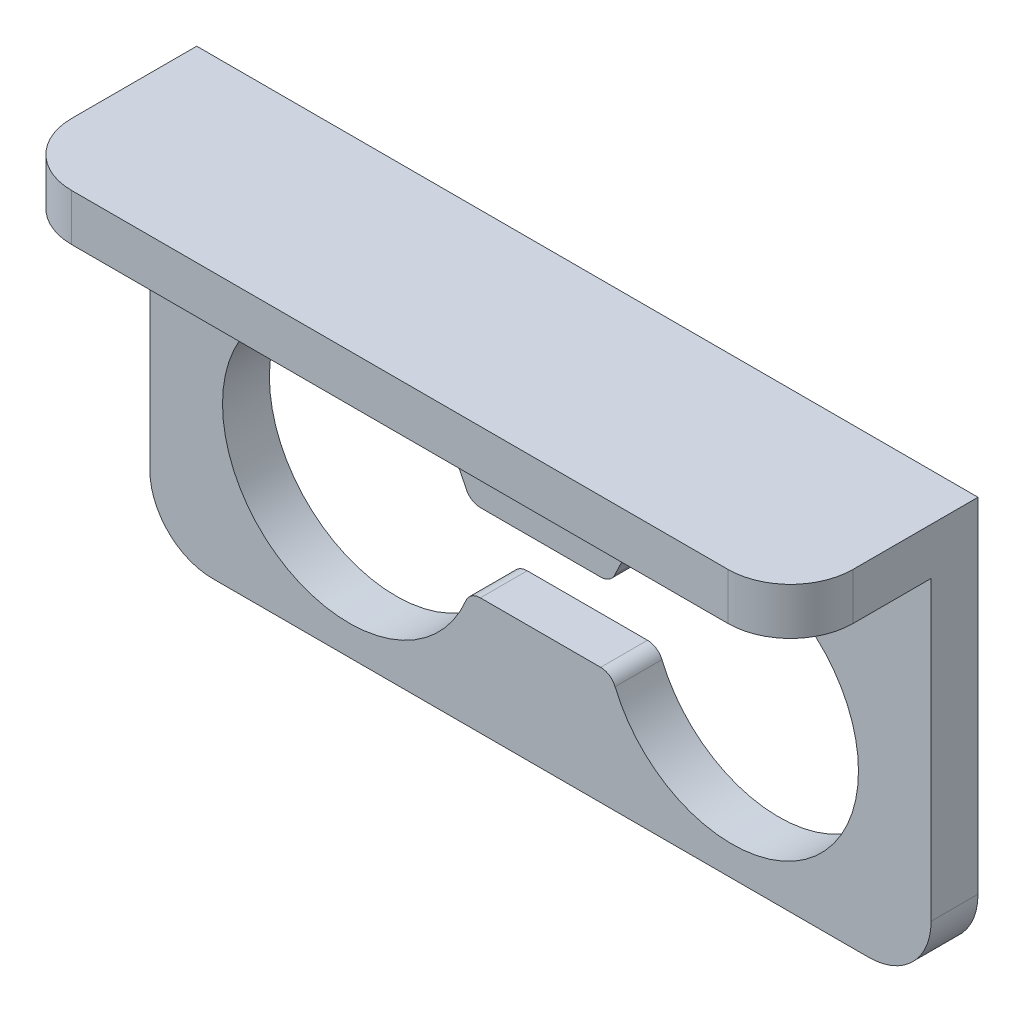
ISO-10303-21;
HEADER;
FILE_DESCRIPTION(('STEP AP214'),'2;1');
FILE_NAME('part.step','',(''),(''),'','','');
FILE_SCHEMA(('AUTOMOTIVE_DESIGN { 1 0 10303 214 1 1 1 1 }'));
ENDSEC;
DATA;
#1=APPLICATION_CONTEXT('core data for automotive mechanical design processes');
#2=APPLICATION_PROTOCOL_DEFINITION('international standard','automotive_design',2000,#1);
#3=PRODUCT_CONTEXT('',#1,'mechanical');
#4=PRODUCT('Part','Part','',(#3));
#5=PRODUCT_RELATED_PRODUCT_CATEGORY('part','',(#4));
#6=PRODUCT_DEFINITION_FORMATION('','',#4);
#7=PRODUCT_DEFINITION_CONTEXT('part definition',#1,'design');
#8=PRODUCT_DEFINITION('design','',#6,#7);
#9=PRODUCT_DEFINITION_SHAPE('','',#8);
#10=(LENGTH_UNIT() NAMED_UNIT(*) SI_UNIT(.MILLI.,.METRE.));
#11=(NAMED_UNIT(*) PLANE_ANGLE_UNIT() SI_UNIT($,.RADIAN.));
#12=(NAMED_UNIT(*) SI_UNIT($,.STERADIAN.) SOLID_ANGLE_UNIT());
#13=UNCERTAINTY_MEASURE_WITH_UNIT(LENGTH_MEASURE(1.E-05),#10,'distance_accuracy_value','');
#14=(GEOMETRIC_REPRESENTATION_CONTEXT(3) GLOBAL_UNCERTAINTY_ASSIGNED_CONTEXT((#13)) GLOBAL_UNIT_ASSIGNED_CONTEXT((#10,
#11,#12)) REPRESENTATION_CONTEXT('',''));
#15=CARTESIAN_POINT('',(0.,0.,0.));
#16=DIRECTION('',(0.,0.,1.));
#17=DIRECTION('',(1.,0.,0.));
#18=AXIS2_PLACEMENT_3D('',#15,#16,#17);
#19=CARTESIAN_POINT('',(-25.,16.,12.));
#20=DIRECTION('',(0.,0.,-1.));
#21=DIRECTION('',(-1.,0.,0.));
#22=AXIS2_PLACEMENT_3D('',#19,#20,#21);
#23=PLANE('',#22);
#24=DIRECTION('',(1.,0.,0.));
#25=VECTOR('',#24,1.);
#26=CARTESIAN_POINT('',(-25.,16.,12.));
#27=LINE('',#26,#25);
#28=CARTESIAN_POINT('',(-21.,16.,12.));
#29=VERTEX_POINT('',#28);
#30=CARTESIAN_POINT('',(21.,16.,12.));
#31=VERTEX_POINT('',#30);
#32=EDGE_CURVE('E221',#29,#31,#27,.T.);
#33=ORIENTED_EDGE('',*,*,#32,.F.);
#34=DIRECTION('',(0.,-1.,0.));
#35=VECTOR('',#34,1.);
#36=CARTESIAN_POINT('',(-21.,16.,12.));
#37=LINE('',#36,#35);
#38=CARTESIAN_POINT('',(-21.,13.,12.));
#39=VERTEX_POINT('',#38);
#40=EDGE_CURVE('E377',#29,#39,#37,.T.);
#41=ORIENTED_EDGE('',*,*,#40,.T.);
#42=DIRECTION('',(-1.,0.,0.));
#43=VECTOR('',#42,1.);
#44=CARTESIAN_POINT('',(25.,13.,12.));
#45=LINE('',#44,#43);
#46=CARTESIAN_POINT('',(21.,13.,12.));
#47=VERTEX_POINT('',#46);
#48=EDGE_CURVE('E201',#47,#39,#45,.T.);
#49=ORIENTED_EDGE('',*,*,#48,.F.);
#50=DIRECTION('',(0.,-1.,0.));
#51=VECTOR('',#50,1.);
#52=CARTESIAN_POINT('',(21.,16.,12.));
#53=LINE('',#52,#51);
#54=EDGE_CURVE('E367',#47,#31,#53,.F.);
#55=ORIENTED_EDGE('',*,*,#54,.T.);
#56=EDGE_LOOP('',(#33,#41,#49,#55));
#57=FACE_BOUND('',#56,.T.);
#58=ADVANCED_FACE('F39',(#57),#23,.F.);
#59=CARTESIAN_POINT('',(0.,0.,3.));
#60=DIRECTION('',(0.,0.,1.));
#61=DIRECTION('',(1.,0.,0.));
#62=AXIS2_PLACEMENT_3D('',#59,#60,#61);
#63=PLANE('',#62);
#64=DIRECTION('',(1.,0.,0.));
#65=VECTOR('',#64,1.);
#66=CARTESIAN_POINT('',(25.,-10.,3.));
#67=LINE('',#66,#65);
#68=CARTESIAN_POINT('',(-21.,-10.,3.));
#69=VERTEX_POINT('',#68);
#70=CARTESIAN_POINT('',(21.,-10.,3.));
#71=VERTEX_POINT('',#70);
#72=EDGE_CURVE('E209',#69,#71,#67,.T.);
#73=ORIENTED_EDGE('',*,*,#72,.T.);
#74=CARTESIAN_POINT('',(21.,-6.,3.));
#75=DIRECTION('',(0.,0.,1.));
#76=DIRECTION('',(1.,0.,0.));
#77=AXIS2_PLACEMENT_3D('',#74,#75,#76);
#78=CIRCLE('',#77,4.);
#79=CARTESIAN_POINT('',(25.,-6.,3.));
#80=VERTEX_POINT('',#79);
#81=EDGE_CURVE('E11',#71,#80,#78,.T.);
#82=ORIENTED_EDGE('',*,*,#81,.T.);
#83=DIRECTION('',(0.,1.,0.));
#84=VECTOR('',#83,1.);
#85=CARTESIAN_POINT('',(25.,-10.,3.));
#86=LINE('',#85,#84);
#87=CARTESIAN_POINT('',(25.,13.,3.));
#88=VERTEX_POINT('',#87);
#89=EDGE_CURVE('E215',#80,#88,#86,.T.);
#90=ORIENTED_EDGE('',*,*,#89,.T.);
#91=DIRECTION('',(1.,0.,0.));
#92=VECTOR('',#91,1.);
#93=CARTESIAN_POINT('',(25.,13.,3.));
#94=LINE('',#93,#92);
#95=CARTESIAN_POINT('',(-25.,13.,3.));
#96=VERTEX_POINT('',#95);
#97=EDGE_CURVE('E195',#96,#88,#94,.T.);
#98=ORIENTED_EDGE('',*,*,#97,.F.);
#99=DIRECTION('',(0.,-1.,0.));
#100=VECTOR('',#99,1.);
#101=CARTESIAN_POINT('',(-25.,-10.,3.));
#102=LINE('',#101,#100);
#103=CARTESIAN_POINT('',(-25.,-6.,3.));
#104=VERTEX_POINT('',#103);
#105=EDGE_CURVE('E203',#96,#104,#102,.T.);
#106=ORIENTED_EDGE('',*,*,#105,.T.);
#107=CARTESIAN_POINT('',(-21.,-6.,3.));
#108=DIRECTION('',(0.,0.,1.));
#109=DIRECTION('',(1.,0.,0.));
#110=AXIS2_PLACEMENT_3D('',#107,#108,#109);
#111=CIRCLE('',#110,4.);
#112=EDGE_CURVE('E48',#104,#69,#111,.T.);
#113=ORIENTED_EDGE('',*,*,#112,.T.);
#114=EDGE_LOOP('',(#73,#82,#90,#98,#106,#113));
#115=FACE_BOUND('',#114,.T.);
#116=CARTESIAN_POINT('',(12.25,0.,3.));
#117=DIRECTION('',(0.,0.,1.));
#118=DIRECTION('',(1.,0.,0.));
#119=AXIS2_PLACEMENT_3D('',#116,#117,#118);
#120=CIRCLE('',#119,8.1);
#121=CARTESIAN_POINT('',(4.77307692307692,-3.11538461538461,3.));
#122=VERTEX_POINT('',#121);
#123=CARTESIAN_POINT('',(4.77307692307692,3.11538461538462,3.));
#124=VERTEX_POINT('',#123);
#125=EDGE_CURVE('E283',#122,#124,#120,.T.);
#126=ORIENTED_EDGE('',*,*,#125,.F.);
#127=CARTESIAN_POINT('',(3.85,-3.5,3.));
#128=DIRECTION('',(0.,0.,-1.));
#129=DIRECTION('',(-1.,0.,0.));
#130=AXIS2_PLACEMENT_3D('',#127,#128,#129);
#131=CIRCLE('',#130,1.);
#132=CARTESIAN_POINT('',(3.85,-2.5,3.));
#133=VERTEX_POINT('',#132);
#134=EDGE_CURVE('E280',#133,#122,#131,.T.);
#135=ORIENTED_EDGE('',*,*,#134,.F.);
#136=DIRECTION('',(1.,0.,0.));
#137=VECTOR('',#136,1.);
#138=CARTESIAN_POINT('',(3.85,-2.5,3.));
#139=LINE('',#138,#137);
#140=CARTESIAN_POINT('',(-3.85,-2.5,3.));
#141=VERTEX_POINT('',#140);
#142=EDGE_CURVE('E303',#141,#133,#139,.T.);
#143=ORIENTED_EDGE('',*,*,#142,.F.);
#144=CARTESIAN_POINT('',(-3.85,-3.5,3.));
#145=DIRECTION('',(0.,0.,-1.));
#146=DIRECTION('',(1.,0.,0.));
#147=AXIS2_PLACEMENT_3D('',#144,#145,#146);
#148=CIRCLE('',#147,1.);
#149=CARTESIAN_POINT('',(-4.77307692307692,-3.11538461538462,3.));
#150=VERTEX_POINT('',#149);
#151=EDGE_CURVE('E299',#150,#141,#148,.T.);
#152=ORIENTED_EDGE('',*,*,#151,.F.);
#153=CARTESIAN_POINT('',(-12.25,0.,3.));
#154=DIRECTION('',(0.,0.,1.));
#155=DIRECTION('',(1.,0.,0.));
#156=AXIS2_PLACEMENT_3D('',#153,#154,#155);
#157=CIRCLE('',#156,8.1);
#158=CARTESIAN_POINT('',(-4.77307692307692,3.11538461538461,3.));
#159=VERTEX_POINT('',#158);
#160=EDGE_CURVE('E296',#159,#150,#157,.T.);
#161=ORIENTED_EDGE('',*,*,#160,.F.);
#162=CARTESIAN_POINT('',(-3.85,3.5,3.));
#163=DIRECTION('',(0.,0.,-1.));
#164=DIRECTION('',(-1.,0.,0.));
#165=AXIS2_PLACEMENT_3D('',#162,#163,#164);
#166=CIRCLE('',#165,1.);
#167=CARTESIAN_POINT('',(-3.85,2.5,3.));
#168=VERTEX_POINT('',#167);
#169=EDGE_CURVE('E293',#168,#159,#166,.T.);
#170=ORIENTED_EDGE('',*,*,#169,.F.);
#171=DIRECTION('',(-1.,0.,0.));
#172=VECTOR('',#171,1.);
#173=CARTESIAN_POINT('',(-3.85,2.5,3.));
#174=LINE('',#173,#172);
#175=CARTESIAN_POINT('',(3.85,2.5,3.));
#176=VERTEX_POINT('',#175);
#177=EDGE_CURVE('E290',#176,#168,#174,.T.);
#178=ORIENTED_EDGE('',*,*,#177,.F.);
#179=CARTESIAN_POINT('',(3.85,3.5,3.));
#180=DIRECTION('',(0.,0.,-1.));
#181=DIRECTION('',(1.,0.,0.));
#182=AXIS2_PLACEMENT_3D('',#179,#180,#181);
#183=CIRCLE('',#182,1.);
#184=EDGE_CURVE('E287',#124,#176,#183,.T.);
#185=ORIENTED_EDGE('',*,*,#184,.F.);
#186=EDGE_LOOP('',(#126,#135,#143,#152,#161,#170,#178,#185));
#187=FACE_BOUND('',#186,.T.);
#188=DIRECTION('',(-1.,0.,0.));
#189=VECTOR('',#188,1.);
#190=CARTESIAN_POINT('',(3.25,9.,3.));
#191=LINE('',#190,#189);
#192=CARTESIAN_POINT('',(3.25,9.,3.));
#193=VERTEX_POINT('',#192);
#194=CARTESIAN_POINT('',(-3.25,9.,3.));
#195=VERTEX_POINT('',#194);
#196=EDGE_CURVE('E240',#193,#195,#191,.T.);
#197=ORIENTED_EDGE('',*,*,#196,.F.);
#198=CARTESIAN_POINT('',(3.25,7.25,3.));
#199=DIRECTION('',(0.,0.,1.));
#200=DIRECTION('',(1.,0.,0.));
#201=AXIS2_PLACEMENT_3D('',#198,#199,#200);
#202=CIRCLE('',#201,1.75);
#203=CARTESIAN_POINT('',(3.25,5.5,3.));
#204=VERTEX_POINT('',#203);
#205=EDGE_CURVE('E237',#204,#193,#202,.T.);
#206=ORIENTED_EDGE('',*,*,#205,.F.);
#207=DIRECTION('',(1.,0.,0.));
#208=VECTOR('',#207,1.);
#209=CARTESIAN_POINT('',(3.25,5.5,3.));
#210=LINE('',#209,#208);
#211=CARTESIAN_POINT('',(-3.25,5.5,3.));
#212=VERTEX_POINT('',#211);
#213=EDGE_CURVE('E248',#212,#204,#210,.T.);
#214=ORIENTED_EDGE('',*,*,#213,.F.);
#215=CARTESIAN_POINT('',(-3.25,7.25,3.));
#216=DIRECTION('',(0.,0.,1.));
#217=DIRECTION('',(1.,0.,0.));
#218=AXIS2_PLACEMENT_3D('',#215,#216,#217);
#219=CIRCLE('',#218,1.75);
#220=EDGE_CURVE('E244',#195,#212,#219,.T.);
#221=ORIENTED_EDGE('',*,*,#220,.F.);
#222=EDGE_LOOP('',(#197,#206,#214,#221));
#223=FACE_BOUND('',#222,.T.);
#224=ADVANCED_FACE('F212',(#115,#187,#223),#63,.T.);
#225=CARTESIAN_POINT('',(0.,0.,0.));
#226=DIRECTION('',(0.,0.,1.));
#227=DIRECTION('',(1.,0.,0.));
#228=AXIS2_PLACEMENT_3D('',#225,#226,#227);
#229=PLANE('',#228);
#230=CARTESIAN_POINT('',(3.85,-3.5,0.));
#231=DIRECTION('',(0.,0.,-1.));
#232=DIRECTION('',(-1.,0.,0.));
#233=AXIS2_PLACEMENT_3D('',#230,#231,#232);
#234=CIRCLE('',#233,1.);
#235=CARTESIAN_POINT('',(3.85,-2.5,0.));
#236=VERTEX_POINT('',#235);
#237=CARTESIAN_POINT('',(4.77307692307692,-3.11538461538461,0.));
#238=VERTEX_POINT('',#237);
#239=EDGE_CURVE('E279',#236,#238,#234,.T.);
#240=ORIENTED_EDGE('',*,*,#239,.T.);
#241=CARTESIAN_POINT('',(12.25,0.,0.));
#242=DIRECTION('',(0.,0.,1.));
#243=DIRECTION('',(1.,0.,0.));
#244=AXIS2_PLACEMENT_3D('',#241,#242,#243);
#245=CIRCLE('',#244,8.1);
#246=CARTESIAN_POINT('',(4.77307692307692,3.11538461538462,0.));
#247=VERTEX_POINT('',#246);
#248=EDGE_CURVE('E310',#238,#247,#245,.T.);
#249=ORIENTED_EDGE('',*,*,#248,.T.);
#250=CARTESIAN_POINT('',(3.85,3.5,0.));
#251=DIRECTION('',(0.,0.,-1.));
#252=DIRECTION('',(1.,0.,0.));
#253=AXIS2_PLACEMENT_3D('',#250,#251,#252);
#254=CIRCLE('',#253,1.);
#255=CARTESIAN_POINT('',(3.85,2.5,0.));
#256=VERTEX_POINT('',#255);
#257=EDGE_CURVE('E314',#247,#256,#254,.T.);
#258=ORIENTED_EDGE('',*,*,#257,.T.);
#259=DIRECTION('',(-1.,0.,0.));
#260=VECTOR('',#259,1.);
#261=CARTESIAN_POINT('',(-3.85,2.5,0.));
#262=LINE('',#261,#260);
#263=CARTESIAN_POINT('',(-3.85,2.5,0.));
#264=VERTEX_POINT('',#263);
#265=EDGE_CURVE('E318',#256,#264,#262,.T.);
#266=ORIENTED_EDGE('',*,*,#265,.T.);
#267=CARTESIAN_POINT('',(-3.85,3.5,0.));
#268=DIRECTION('',(0.,0.,-1.));
#269=DIRECTION('',(-1.,0.,0.));
#270=AXIS2_PLACEMENT_3D('',#267,#268,#269);
#271=CIRCLE('',#270,1.);
#272=CARTESIAN_POINT('',(-4.77307692307692,3.11538461538461,0.));
#273=VERTEX_POINT('',#272);
#274=EDGE_CURVE('E322',#264,#273,#271,.T.);
#275=ORIENTED_EDGE('',*,*,#274,.T.);
#276=CARTESIAN_POINT('',(-12.25,0.,0.));
#277=DIRECTION('',(0.,0.,1.));
#278=DIRECTION('',(1.,0.,0.));
#279=AXIS2_PLACEMENT_3D('',#276,#277,#278);
#280=CIRCLE('',#279,8.1);
#281=CARTESIAN_POINT('',(-4.77307692307692,-3.11538461538462,0.));
#282=VERTEX_POINT('',#281);
#283=EDGE_CURVE('E326',#273,#282,#280,.T.);
#284=ORIENTED_EDGE('',*,*,#283,.T.);
#285=CARTESIAN_POINT('',(-3.85,-3.5,0.));
#286=DIRECTION('',(0.,0.,-1.));
#287=DIRECTION('',(1.,0.,0.));
#288=AXIS2_PLACEMENT_3D('',#285,#286,#287);
#289=CIRCLE('',#288,1.);
#290=CARTESIAN_POINT('',(-3.85,-2.5,0.));
#291=VERTEX_POINT('',#290);
#292=EDGE_CURVE('E330',#282,#291,#289,.T.);
#293=ORIENTED_EDGE('',*,*,#292,.T.);
#294=DIRECTION('',(1.,0.,0.));
#295=VECTOR('',#294,1.);
#296=CARTESIAN_POINT('',(3.85,-2.5,0.));
#297=LINE('',#296,#295);
#298=EDGE_CURVE('E284',#291,#236,#297,.T.);
#299=ORIENTED_EDGE('',*,*,#298,.T.);
#300=EDGE_LOOP('',(#240,#249,#258,#266,#275,#284,#293,#299));
#301=FACE_BOUND('',#300,.T.);
#302=DIRECTION('',(0.,1.,0.));
#303=VECTOR('',#302,1.);
#304=CARTESIAN_POINT('',(25.,-10.,0.));
#305=LINE('',#304,#303);
#306=CARTESIAN_POINT('',(25.,-6.,0.));
#307=VERTEX_POINT('',#306);
#308=CARTESIAN_POINT('',(25.,16.,0.));
#309=VERTEX_POINT('',#308);
#310=EDGE_CURVE('E210',#307,#309,#305,.T.);
#311=ORIENTED_EDGE('',*,*,#310,.F.);
#312=CARTESIAN_POINT('',(21.,-6.,0.));
#313=DIRECTION('',(0.,0.,1.));
#314=DIRECTION('',(1.,0.,0.));
#315=AXIS2_PLACEMENT_3D('',#312,#313,#314);
#316=CIRCLE('',#315,4.);
#317=CARTESIAN_POINT('',(21.,-10.,0.));
#318=VERTEX_POINT('',#317);
#319=EDGE_CURVE('E408',#307,#318,#316,.F.);
#320=ORIENTED_EDGE('',*,*,#319,.T.);
#321=DIRECTION('',(1.,0.,0.));
#322=VECTOR('',#321,1.);
#323=CARTESIAN_POINT('',(25.,-10.,0.));
#324=LINE('',#323,#322);
#325=CARTESIAN_POINT('',(-21.,-10.,0.));
#326=VERTEX_POINT('',#325);
#327=EDGE_CURVE('E370',#326,#318,#324,.T.);
#328=ORIENTED_EDGE('',*,*,#327,.F.);
#329=CARTESIAN_POINT('',(-21.,-6.,0.));
#330=DIRECTION('',(0.,0.,1.));
#331=DIRECTION('',(1.,0.,0.));
#332=AXIS2_PLACEMENT_3D('',#329,#330,#331);
#333=CIRCLE('',#332,4.);
#334=CARTESIAN_POINT('',(-25.,-6.,0.));
#335=VERTEX_POINT('',#334);
#336=EDGE_CURVE('E405',#326,#335,#333,.F.);
#337=ORIENTED_EDGE('',*,*,#336,.T.);
#338=DIRECTION('',(0.,-1.,0.));
#339=VECTOR('',#338,1.);
#340=CARTESIAN_POINT('',(-25.,-10.,0.));
#341=LINE('',#340,#339);
#342=CARTESIAN_POINT('',(-25.,16.,0.));
#343=VERTEX_POINT('',#342);
#344=EDGE_CURVE('E361',#343,#335,#341,.T.);
#345=ORIENTED_EDGE('',*,*,#344,.F.);
#346=DIRECTION('',(-1.,0.,0.));
#347=VECTOR('',#346,1.);
#348=CARTESIAN_POINT('',(-25.,16.,0.));
#349=LINE('',#348,#347);
#350=EDGE_CURVE('E232',#309,#343,#349,.T.);
#351=ORIENTED_EDGE('',*,*,#350,.F.);
#352=EDGE_LOOP('',(#311,#320,#328,#337,#345,#351));
#353=FACE_BOUND('',#352,.T.);
#354=CARTESIAN_POINT('',(3.25,7.25,0.));
#355=DIRECTION('',(0.,0.,1.));
#356=DIRECTION('',(1.,0.,0.));
#357=AXIS2_PLACEMENT_3D('',#354,#355,#356);
#358=CIRCLE('',#357,1.75);
#359=CARTESIAN_POINT('',(3.25,5.5,0.));
#360=VERTEX_POINT('',#359);
#361=CARTESIAN_POINT('',(3.25,9.,0.));
#362=VERTEX_POINT('',#361);
#363=EDGE_CURVE('E236',#360,#362,#358,.T.);
#364=ORIENTED_EDGE('',*,*,#363,.T.);
#365=DIRECTION('',(-1.,0.,0.));
#366=VECTOR('',#365,1.);
#367=CARTESIAN_POINT('',(3.25,9.,0.));
#368=LINE('',#367,#366);
#369=CARTESIAN_POINT('',(-3.25,9.,0.));
#370=VERTEX_POINT('',#369);
#371=EDGE_CURVE('E255',#362,#370,#368,.T.);
#372=ORIENTED_EDGE('',*,*,#371,.T.);
#373=CARTESIAN_POINT('',(-3.25,7.25,0.));
#374=DIRECTION('',(0.,0.,1.));
#375=DIRECTION('',(1.,0.,0.));
#376=AXIS2_PLACEMENT_3D('',#373,#374,#375);
#377=CIRCLE('',#376,1.75);
#378=CARTESIAN_POINT('',(-3.25,5.5,0.));
#379=VERTEX_POINT('',#378);
#380=EDGE_CURVE('E259',#370,#379,#377,.T.);
#381=ORIENTED_EDGE('',*,*,#380,.T.);
#382=DIRECTION('',(1.,0.,0.));
#383=VECTOR('',#382,1.);
#384=CARTESIAN_POINT('',(3.25,5.5,0.));
#385=LINE('',#384,#383);
#386=EDGE_CURVE('E241',#379,#360,#385,.T.);
#387=ORIENTED_EDGE('',*,*,#386,.T.);
#388=EDGE_LOOP('',(#364,#372,#381,#387));
#389=FACE_BOUND('',#388,.T.);
#390=ADVANCED_FACE('F423',(#301,#353,#389),#229,.F.);
#391=CARTESIAN_POINT('',(-25.,-10.,3.));
#392=DIRECTION('',(1.,0.,0.));
#393=DIRECTION('',(0.,0.,-1.));
#394=AXIS2_PLACEMENT_3D('',#391,#392,#393);
#395=PLANE('',#394);
#396=DIRECTION('',(0.,0.,-1.));
#397=VECTOR('',#396,1.);
#398=CARTESIAN_POINT('',(-25.,13.,3.));
#399=LINE('',#398,#397);
#400=CARTESIAN_POINT('',(-25.,13.,8.));
#401=VERTEX_POINT('',#400);
#402=EDGE_CURVE('E189',#401,#96,#399,.T.);
#403=ORIENTED_EDGE('',*,*,#402,.F.);
#404=DIRECTION('',(0.,-1.,0.));
#405=VECTOR('',#404,1.);
#406=CARTESIAN_POINT('',(-25.,-10.,8.));
#407=LINE('',#406,#405);
#408=CARTESIAN_POINT('',(-25.,16.,8.));
#409=VERTEX_POINT('',#408);
#410=EDGE_CURVE('E388',#401,#409,#407,.F.);
#411=ORIENTED_EDGE('',*,*,#410,.T.);
#412=DIRECTION('',(0.,0.,1.));
#413=VECTOR('',#412,1.);
#414=CARTESIAN_POINT('',(-25.,16.,0.));
#415=LINE('',#414,#413);
#416=EDGE_CURVE('E217',#343,#409,#415,.T.);
#417=ORIENTED_EDGE('',*,*,#416,.F.);
#418=ORIENTED_EDGE('',*,*,#344,.T.);
#419=DIRECTION('',(0.,0.,-1.));
#420=VECTOR('',#419,1.);
#421=CARTESIAN_POINT('',(-25.,-6.,3.));
#422=LINE('',#421,#420);
#423=EDGE_CURVE('E207',#335,#104,#422,.F.);
#424=ORIENTED_EDGE('',*,*,#423,.T.);
#425=ORIENTED_EDGE('',*,*,#105,.F.);
#426=EDGE_LOOP('',(#403,#411,#417,#418,#424,#425));
#427=FACE_BOUND('',#426,.T.);
#428=ADVANCED_FACE('F204',(#427),#395,.F.);
#429=CARTESIAN_POINT('',(25.,-10.,3.));
#430=DIRECTION('',(0.,1.,0.));
#431=DIRECTION('',(-1.,0.,0.));
#432=AXIS2_PLACEMENT_3D('',#429,#430,#431);
#433=PLANE('',#432);
#434=ORIENTED_EDGE('',*,*,#327,.T.);
#435=DIRECTION('',(0.,0.,-1.));
#436=VECTOR('',#435,1.);
#437=CARTESIAN_POINT('',(21.,-10.,3.));
#438=LINE('',#437,#436);
#439=EDGE_CURVE('E55',#318,#71,#438,.F.);
#440=ORIENTED_EDGE('',*,*,#439,.T.);
#441=ORIENTED_EDGE('',*,*,#72,.F.);
#442=DIRECTION('',(0.,0.,-1.));
#443=VECTOR('',#442,1.);
#444=CARTESIAN_POINT('',(-21.,-10.,3.));
#445=LINE('',#444,#443);
#446=EDGE_CURVE('E411',#69,#326,#445,.T.);
#447=ORIENTED_EDGE('',*,*,#446,.T.);
#448=EDGE_LOOP('',(#434,#440,#441,#447));
#449=FACE_BOUND('',#448,.T.);
#450=ADVANCED_FACE('F419',(#449),#433,.F.);
#451=CARTESIAN_POINT('',(25.,-10.,3.));
#452=DIRECTION('',(-1.,0.,0.));
#453=DIRECTION('',(0.,0.,1.));
#454=AXIS2_PLACEMENT_3D('',#451,#452,#453);
#455=PLANE('',#454);
#456=DIRECTION('',(0.,0.,-1.));
#457=VECTOR('',#456,1.);
#458=CARTESIAN_POINT('',(25.,16.,0.));
#459=LINE('',#458,#457);
#460=CARTESIAN_POINT('',(25.,16.,8.));
#461=VERTEX_POINT('',#460);
#462=EDGE_CURVE('E228',#461,#309,#459,.T.);
#463=ORIENTED_EDGE('',*,*,#462,.F.);
#464=DIRECTION('',(0.,-1.,0.));
#465=VECTOR('',#464,1.);
#466=CARTESIAN_POINT('',(25.,-10.,8.));
#467=LINE('',#466,#465);
#468=CARTESIAN_POINT('',(25.,13.,8.));
#469=VERTEX_POINT('',#468);
#470=EDGE_CURVE('E401',#461,#469,#467,.T.);
#471=ORIENTED_EDGE('',*,*,#470,.T.);
#472=DIRECTION('',(0.,0.,1.));
#473=VECTOR('',#472,1.);
#474=CARTESIAN_POINT('',(25.,13.,3.));
#475=LINE('',#474,#473);
#476=EDGE_CURVE('E433',#88,#469,#475,.T.);
#477=ORIENTED_EDGE('',*,*,#476,.F.);
#478=ORIENTED_EDGE('',*,*,#89,.F.);
#479=DIRECTION('',(0.,0.,-1.));
#480=VECTOR('',#479,1.);
#481=CARTESIAN_POINT('',(25.,-6.,3.));
#482=LINE('',#481,#480);
#483=EDGE_CURVE('E397',#80,#307,#482,.T.);
#484=ORIENTED_EDGE('',*,*,#483,.T.);
#485=ORIENTED_EDGE('',*,*,#310,.T.);
#486=EDGE_LOOP('',(#463,#471,#477,#478,#484,#485));
#487=FACE_BOUND('',#486,.T.);
#488=ADVANCED_FACE('F432',(#487),#455,.F.);
#489=CARTESIAN_POINT('',(3.85,-3.5,3.));
#490=DIRECTION('',(0.,0.,-1.));
#491=DIRECTION('',(-1.,0.,0.));
#492=AXIS2_PLACEMENT_3D('',#489,#490,#491);
#493=CYLINDRICAL_SURFACE('',#492,1.);
#494=ORIENTED_EDGE('',*,*,#239,.F.);
#495=DIRECTION('',(0.,0.,-1.));
#496=VECTOR('',#495,1.);
#497=CARTESIAN_POINT('',(3.85,-2.5,3.));
#498=LINE('',#497,#496);
#499=EDGE_CURVE('E306',#133,#236,#498,.T.);
#500=ORIENTED_EDGE('',*,*,#499,.F.);
#501=ORIENTED_EDGE('',*,*,#134,.T.);
#502=DIRECTION('',(0.,0.,-1.));
#503=VECTOR('',#502,1.);
#504=CARTESIAN_POINT('',(4.77307692307692,-3.11538461538461,3.));
#505=LINE('',#504,#503);
#506=EDGE_CURVE('E358',#122,#238,#505,.T.);
#507=ORIENTED_EDGE('',*,*,#506,.T.);
#508=EDGE_LOOP('',(#494,#500,#501,#507));
#509=FACE_BOUND('',#508,.T.);
#510=ADVANCED_FACE('F508',(#509),#493,.T.);
#511=CARTESIAN_POINT('',(12.25,0.,3.));
#512=DIRECTION('',(0.,0.,-1.));
#513=DIRECTION('',(-1.,0.,0.));
#514=AXIS2_PLACEMENT_3D('',#511,#512,#513);
#515=CYLINDRICAL_SURFACE('',#514,8.1);
#516=ORIENTED_EDGE('',*,*,#248,.F.);
#517=ORIENTED_EDGE('',*,*,#506,.F.);
#518=ORIENTED_EDGE('',*,*,#125,.T.);
#519=DIRECTION('',(0.,0.,-1.));
#520=VECTOR('',#519,1.);
#521=CARTESIAN_POINT('',(4.77307692307692,3.11538461538462,3.));
#522=LINE('',#521,#520);
#523=EDGE_CURVE('E355',#124,#247,#522,.T.);
#524=ORIENTED_EDGE('',*,*,#523,.T.);
#525=EDGE_LOOP('',(#516,#517,#518,#524));
#526=FACE_BOUND('',#525,.T.);
#527=ADVANCED_FACE('F504',(#526),#515,.F.);
#528=CARTESIAN_POINT('',(3.85,3.5,3.));
#529=DIRECTION('',(0.,0.,-1.));
#530=DIRECTION('',(-1.,0.,0.));
#531=AXIS2_PLACEMENT_3D('',#528,#529,#530);
#532=CYLINDRICAL_SURFACE('',#531,1.);
#533=ORIENTED_EDGE('',*,*,#257,.F.);
#534=ORIENTED_EDGE('',*,*,#523,.F.);
#535=ORIENTED_EDGE('',*,*,#184,.T.);
#536=DIRECTION('',(0.,0.,-1.));
#537=VECTOR('',#536,1.);
#538=CARTESIAN_POINT('',(3.85,2.5,3.));
#539=LINE('',#538,#537);
#540=EDGE_CURVE('E352',#176,#256,#539,.T.);
#541=ORIENTED_EDGE('',*,*,#540,.T.);
#542=EDGE_LOOP('',(#533,#534,#535,#541));
#543=FACE_BOUND('',#542,.T.);
#544=ADVANCED_FACE('F500',(#543),#532,.T.);
#545=CARTESIAN_POINT('',(-3.85,2.5,3.));
#546=DIRECTION('',(0.,-1.,0.));
#547=DIRECTION('',(0.,0.,-1.));
#548=AXIS2_PLACEMENT_3D('',#545,#546,#547);
#549=PLANE('',#548);
#550=ORIENTED_EDGE('',*,*,#265,.F.);
#551=ORIENTED_EDGE('',*,*,#540,.F.);
#552=ORIENTED_EDGE('',*,*,#177,.T.);
#553=DIRECTION('',(0.,0.,-1.));
#554=VECTOR('',#553,1.);
#555=CARTESIAN_POINT('',(-3.85,2.5,3.));
#556=LINE('',#555,#554);
#557=EDGE_CURVE('E349',#168,#264,#556,.T.);
#558=ORIENTED_EDGE('',*,*,#557,.T.);
#559=EDGE_LOOP('',(#550,#551,#552,#558));
#560=FACE_BOUND('',#559,.T.);
#561=ADVANCED_FACE('F496',(#560),#549,.T.);
#562=CARTESIAN_POINT('',(-3.85,3.5,3.));
#563=DIRECTION('',(0.,0.,-1.));
#564=DIRECTION('',(-1.,0.,0.));
#565=AXIS2_PLACEMENT_3D('',#562,#563,#564);
#566=CYLINDRICAL_SURFACE('',#565,1.);
#567=ORIENTED_EDGE('',*,*,#274,.F.);
#568=ORIENTED_EDGE('',*,*,#557,.F.);
#569=ORIENTED_EDGE('',*,*,#169,.T.);
#570=DIRECTION('',(0.,0.,-1.));
#571=VECTOR('',#570,1.);
#572=CARTESIAN_POINT('',(-4.77307692307692,3.11538461538461,3.));
#573=LINE('',#572,#571);
#574=EDGE_CURVE('E346',#159,#273,#573,.T.);
#575=ORIENTED_EDGE('',*,*,#574,.T.);
#576=EDGE_LOOP('',(#567,#568,#569,#575));
#577=FACE_BOUND('',#576,.T.);
#578=ADVANCED_FACE('F492',(#577),#566,.T.);
#579=CARTESIAN_POINT('',(-12.25,0.,3.));
#580=DIRECTION('',(0.,0.,-1.));
#581=DIRECTION('',(-1.,0.,0.));
#582=AXIS2_PLACEMENT_3D('',#579,#580,#581);
#583=CYLINDRICAL_SURFACE('',#582,8.1);
#584=ORIENTED_EDGE('',*,*,#283,.F.);
#585=ORIENTED_EDGE('',*,*,#574,.F.);
#586=ORIENTED_EDGE('',*,*,#160,.T.);
#587=DIRECTION('',(0.,0.,-1.));
#588=VECTOR('',#587,1.);
#589=CARTESIAN_POINT('',(-4.77307692307692,-3.11538461538462,3.));
#590=LINE('',#589,#588);
#591=EDGE_CURVE('E343',#150,#282,#590,.T.);
#592=ORIENTED_EDGE('',*,*,#591,.T.);
#593=EDGE_LOOP('',(#584,#585,#586,#592));
#594=FACE_BOUND('',#593,.T.);
#595=ADVANCED_FACE('F488',(#594),#583,.F.);
#596=CARTESIAN_POINT('',(-3.85,-3.5,3.));
#597=DIRECTION('',(0.,0.,-1.));
#598=DIRECTION('',(-1.,0.,0.));
#599=AXIS2_PLACEMENT_3D('',#596,#597,#598);
#600=CYLINDRICAL_SURFACE('',#599,1.);
#601=ORIENTED_EDGE('',*,*,#292,.F.);
#602=ORIENTED_EDGE('',*,*,#591,.F.);
#603=ORIENTED_EDGE('',*,*,#151,.T.);
#604=DIRECTION('',(0.,0.,-1.));
#605=VECTOR('',#604,1.);
#606=CARTESIAN_POINT('',(-3.85,-2.5,3.));
#607=LINE('',#606,#605);
#608=EDGE_CURVE('E340',#141,#291,#607,.T.);
#609=ORIENTED_EDGE('',*,*,#608,.T.);
#610=EDGE_LOOP('',(#601,#602,#603,#609));
#611=FACE_BOUND('',#610,.T.);
#612=ADVANCED_FACE('F484',(#611),#600,.T.);
#613=CARTESIAN_POINT('',(3.85,-2.5,3.));
#614=DIRECTION('',(0.,1.,0.));
#615=DIRECTION('',(-1.,0.,0.));
#616=AXIS2_PLACEMENT_3D('',#613,#614,#615);
#617=PLANE('',#616);
#618=ORIENTED_EDGE('',*,*,#298,.F.);
#619=ORIENTED_EDGE('',*,*,#608,.F.);
#620=ORIENTED_EDGE('',*,*,#142,.T.);
#621=ORIENTED_EDGE('',*,*,#499,.T.);
#622=EDGE_LOOP('',(#618,#619,#620,#621));
#623=FACE_BOUND('',#622,.T.);
#624=ADVANCED_FACE('F480',(#623),#617,.T.);
#625=CARTESIAN_POINT('',(3.25,7.25,3.));
#626=DIRECTION('',(0.,0.,-1.));
#627=DIRECTION('',(-1.,0.,0.));
#628=AXIS2_PLACEMENT_3D('',#625,#626,#627);
#629=CYLINDRICAL_SURFACE('',#628,1.75);
#630=ORIENTED_EDGE('',*,*,#363,.F.);
#631=DIRECTION('',(0.,0.,-1.));
#632=VECTOR('',#631,1.);
#633=CARTESIAN_POINT('',(3.25,5.5,3.));
#634=LINE('',#633,#632);
#635=EDGE_CURVE('E251',#204,#360,#634,.T.);
#636=ORIENTED_EDGE('',*,*,#635,.F.);
#637=ORIENTED_EDGE('',*,*,#205,.T.);
#638=DIRECTION('',(0.,0.,-1.));
#639=VECTOR('',#638,1.);
#640=CARTESIAN_POINT('',(3.25,9.,3.));
#641=LINE('',#640,#639);
#642=EDGE_CURVE('E275',#193,#362,#641,.T.);
#643=ORIENTED_EDGE('',*,*,#642,.T.);
#644=EDGE_LOOP('',(#630,#636,#637,#643));
#645=FACE_BOUND('',#644,.T.);
#646=ADVANCED_FACE('F476',(#645),#629,.F.);
#647=CARTESIAN_POINT('',(3.25,9.,3.));
#648=DIRECTION('',(0.,-1.,0.));
#649=DIRECTION('',(1.,0.,0.));
#650=AXIS2_PLACEMENT_3D('',#647,#648,#649);
#651=PLANE('',#650);
#652=ORIENTED_EDGE('',*,*,#371,.F.);
#653=ORIENTED_EDGE('',*,*,#642,.F.);
#654=ORIENTED_EDGE('',*,*,#196,.T.);
#655=DIRECTION('',(0.,0.,-1.));
#656=VECTOR('',#655,1.);
#657=CARTESIAN_POINT('',(-3.25,9.,3.));
#658=LINE('',#657,#656);
#659=EDGE_CURVE('E272',#195,#370,#658,.T.);
#660=ORIENTED_EDGE('',*,*,#659,.T.);
#661=EDGE_LOOP('',(#652,#653,#654,#660));
#662=FACE_BOUND('',#661,.T.);
#663=ADVANCED_FACE('F472',(#662),#651,.T.);
#664=CARTESIAN_POINT('',(-3.25,7.25,3.));
#665=DIRECTION('',(0.,0.,-1.));
#666=DIRECTION('',(-1.,0.,0.));
#667=AXIS2_PLACEMENT_3D('',#664,#665,#666);
#668=CYLINDRICAL_SURFACE('',#667,1.75);
#669=ORIENTED_EDGE('',*,*,#380,.F.);
#670=ORIENTED_EDGE('',*,*,#659,.F.);
#671=ORIENTED_EDGE('',*,*,#220,.T.);
#672=DIRECTION('',(0.,0.,-1.));
#673=VECTOR('',#672,1.);
#674=CARTESIAN_POINT('',(-3.25,5.5,3.));
#675=LINE('',#674,#673);
#676=EDGE_CURVE('E269',#212,#379,#675,.T.);
#677=ORIENTED_EDGE('',*,*,#676,.T.);
#678=EDGE_LOOP('',(#669,#670,#671,#677));
#679=FACE_BOUND('',#678,.T.);
#680=ADVANCED_FACE('F468',(#679),#668,.F.);
#681=CARTESIAN_POINT('',(3.25,5.5,3.));
#682=DIRECTION('',(0.,1.,0.));
#683=DIRECTION('',(0.,0.,1.));
#684=AXIS2_PLACEMENT_3D('',#681,#682,#683);
#685=PLANE('',#684);
#686=ORIENTED_EDGE('',*,*,#386,.F.);
#687=ORIENTED_EDGE('',*,*,#676,.F.);
#688=ORIENTED_EDGE('',*,*,#213,.T.);
#689=ORIENTED_EDGE('',*,*,#635,.T.);
#690=EDGE_LOOP('',(#686,#687,#688,#689));
#691=FACE_BOUND('',#690,.T.);
#692=ADVANCED_FACE('F465',(#691),#685,.T.);
#693=CARTESIAN_POINT('',(0.,16.,0.));
#694=DIRECTION('',(0.,1.,0.));
#695=DIRECTION('',(-1.,0.,0.));
#696=AXIS2_PLACEMENT_3D('',#693,#694,#695);
#697=PLANE('',#696);
#698=ORIENTED_EDGE('',*,*,#416,.T.);
#699=CARTESIAN_POINT('',(-21.,16.,8.));
#700=DIRECTION('',(0.,1.,0.));
#701=DIRECTION('',(-1.,0.,0.));
#702=AXIS2_PLACEMENT_3D('',#699,#700,#701);
#703=CIRCLE('',#702,4.);
#704=EDGE_CURVE('E394',#409,#29,#703,.T.);
#705=ORIENTED_EDGE('',*,*,#704,.T.);
#706=ORIENTED_EDGE('',*,*,#32,.T.);
#707=CARTESIAN_POINT('',(21.,16.,8.));
#708=DIRECTION('',(0.,1.,0.));
#709=DIRECTION('',(-1.,0.,0.));
#710=AXIS2_PLACEMENT_3D('',#707,#708,#709);
#711=CIRCLE('',#710,4.);
#712=EDGE_CURVE('E391',#31,#461,#711,.T.);
#713=ORIENTED_EDGE('',*,*,#712,.T.);
#714=ORIENTED_EDGE('',*,*,#462,.T.);
#715=ORIENTED_EDGE('',*,*,#350,.T.);
#716=EDGE_LOOP('',(#698,#705,#706,#713,#714,#715));
#717=FACE_BOUND('',#716,.T.);
#718=ADVANCED_FACE('F447',(#717),#697,.T.);
#719=CARTESIAN_POINT('',(0.,13.,0.));
#720=DIRECTION('',(0.,-1.,0.));
#721=DIRECTION('',(1.,0.,0.));
#722=AXIS2_PLACEMENT_3D('',#719,#720,#721);
#723=PLANE('',#722);
#724=ORIENTED_EDGE('',*,*,#48,.T.);
#725=CARTESIAN_POINT('',(-21.,13.,8.));
#726=DIRECTION('',(0.,-1.,0.));
#727=DIRECTION('',(1.,0.,0.));
#728=AXIS2_PLACEMENT_3D('',#725,#726,#727);
#729=CIRCLE('',#728,4.);
#730=EDGE_CURVE('E197',#39,#401,#729,.T.);
#731=ORIENTED_EDGE('',*,*,#730,.T.);
#732=ORIENTED_EDGE('',*,*,#402,.T.);
#733=ORIENTED_EDGE('',*,*,#97,.T.);
#734=ORIENTED_EDGE('',*,*,#476,.T.);
#735=CARTESIAN_POINT('',(21.,13.,8.));
#736=DIRECTION('',(0.,-1.,0.));
#737=DIRECTION('',(1.,0.,0.));
#738=AXIS2_PLACEMENT_3D('',#735,#736,#737);
#739=CIRCLE('',#738,4.);
#740=EDGE_CURVE('E381',#469,#47,#739,.T.);
#741=ORIENTED_EDGE('',*,*,#740,.T.);
#742=EDGE_LOOP('',(#724,#731,#732,#733,#734,#741));
#743=FACE_BOUND('',#742,.T.);
#744=ADVANCED_FACE('F192',(#743),#723,.T.);
#745=CARTESIAN_POINT('',(-21.,16.,8.));
#746=DIRECTION('',(0.,-1.,0.));
#747=DIRECTION('',(0.,0.,-1.));
#748=AXIS2_PLACEMENT_3D('',#745,#746,#747);
#749=CYLINDRICAL_SURFACE('',#748,4.);
#750=ORIENTED_EDGE('',*,*,#704,.F.);
#751=ORIENTED_EDGE('',*,*,#410,.F.);
#752=ORIENTED_EDGE('',*,*,#730,.F.);
#753=ORIENTED_EDGE('',*,*,#40,.F.);
#754=EDGE_LOOP('',(#750,#751,#752,#753));
#755=FACE_BOUND('',#754,.T.);
#756=ADVANCED_FACE('F450',(#755),#749,.T.);
#757=CARTESIAN_POINT('',(21.,-10.,8.));
#758=DIRECTION('',(0.,-1.,0.));
#759=DIRECTION('',(0.,0.,-1.));
#760=AXIS2_PLACEMENT_3D('',#757,#758,#759);
#761=CYLINDRICAL_SURFACE('',#760,4.);
#762=ORIENTED_EDGE('',*,*,#712,.F.);
#763=ORIENTED_EDGE('',*,*,#54,.F.);
#764=ORIENTED_EDGE('',*,*,#740,.F.);
#765=ORIENTED_EDGE('',*,*,#470,.F.);
#766=EDGE_LOOP('',(#762,#763,#764,#765));
#767=FACE_BOUND('',#766,.T.);
#768=ADVANCED_FACE('F445',(#767),#761,.T.);
#769=CARTESIAN_POINT('',(21.,-6.,3.));
#770=DIRECTION('',(0.,0.,-1.));
#771=DIRECTION('',(-1.,0.,0.));
#772=AXIS2_PLACEMENT_3D('',#769,#770,#771);
#773=CYLINDRICAL_SURFACE('',#772,4.);
#774=ORIENTED_EDGE('',*,*,#81,.F.);
#775=ORIENTED_EDGE('',*,*,#439,.F.);
#776=ORIENTED_EDGE('',*,*,#319,.F.);
#777=ORIENTED_EDGE('',*,*,#483,.F.);
#778=EDGE_LOOP('',(#774,#775,#776,#777));
#779=FACE_BOUND('',#778,.T.);
#780=ADVANCED_FACE('F429',(#779),#773,.T.);
#781=CARTESIAN_POINT('',(-21.,-6.,3.));
#782=DIRECTION('',(0.,0.,-1.));
#783=DIRECTION('',(-1.,0.,0.));
#784=AXIS2_PLACEMENT_3D('',#781,#782,#783);
#785=CYLINDRICAL_SURFACE('',#784,4.);
#786=ORIENTED_EDGE('',*,*,#112,.F.);
#787=ORIENTED_EDGE('',*,*,#423,.F.);
#788=ORIENTED_EDGE('',*,*,#336,.F.);
#789=ORIENTED_EDGE('',*,*,#446,.F.);
#790=EDGE_LOOP('',(#786,#787,#788,#789));
#791=FACE_BOUND('',#790,.T.);
#792=ADVANCED_FACE('F41',(#791),#785,.T.);
#793=CLOSED_SHELL('',(#58,#224,#390,#428,#450,#488,#510,#527,#544,#561,#578,#595,#612,#624,#646,
#663,#680,#692,#718,#744,#756,#768,#780,#792));
#794=MANIFOLD_SOLID_BREP('B2',#793);
#795=ADVANCED_BREP_SHAPE_REPRESENTATION('',(#18,#794),#14);
#796=SHAPE_DEFINITION_REPRESENTATION(#9,#795);
ENDSEC;
END-ISO-10303-21;
